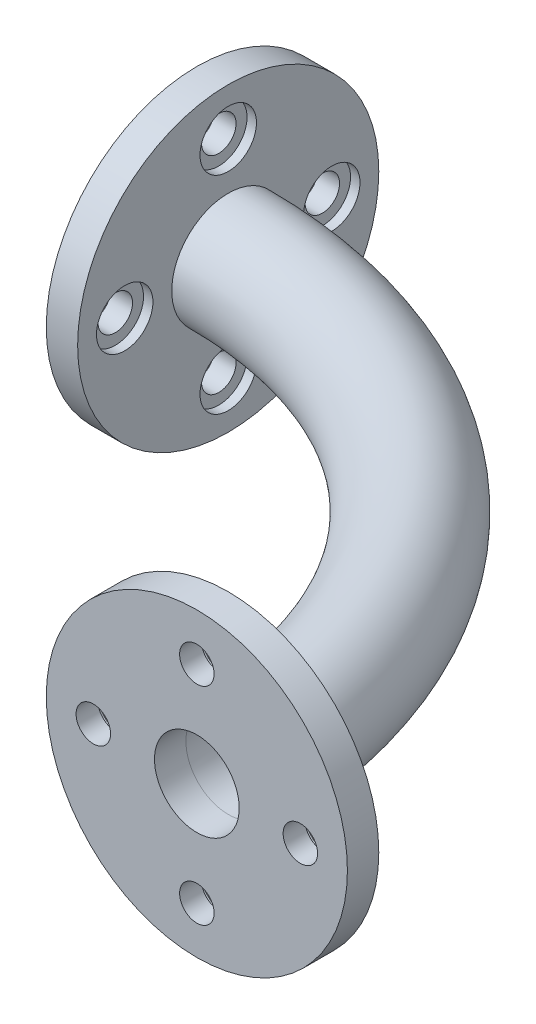
ISO-10303-21;
HEADER;
FILE_DESCRIPTION(('STEP AP214'),'2;1');
FILE_NAME('part.step','',(''),(''),'','','');
FILE_SCHEMA(('AUTOMOTIVE_DESIGN { 1 0 10303 214 1 1 1 1 }'));
ENDSEC;
DATA;
#1=APPLICATION_CONTEXT('core data for automotive mechanical design processes');
#2=APPLICATION_PROTOCOL_DEFINITION('international standard','automotive_design',2000,#1);
#3=PRODUCT_CONTEXT('',#1,'mechanical');
#4=PRODUCT('Part','Part','',(#3));
#5=PRODUCT_RELATED_PRODUCT_CATEGORY('part','',(#4));
#6=PRODUCT_DEFINITION_FORMATION('','',#4);
#7=PRODUCT_DEFINITION_CONTEXT('part definition',#1,'design');
#8=PRODUCT_DEFINITION('design','',#6,#7);
#9=PRODUCT_DEFINITION_SHAPE('','',#8);
#10=(LENGTH_UNIT() NAMED_UNIT(*) SI_UNIT(.MILLI.,.METRE.));
#11=(NAMED_UNIT(*) PLANE_ANGLE_UNIT() SI_UNIT($,.RADIAN.));
#12=(NAMED_UNIT(*) SI_UNIT($,.STERADIAN.) SOLID_ANGLE_UNIT());
#13=UNCERTAINTY_MEASURE_WITH_UNIT(LENGTH_MEASURE(1.E-05),#10,'distance_accuracy_value','');
#14=(GEOMETRIC_REPRESENTATION_CONTEXT(3) GLOBAL_UNCERTAINTY_ASSIGNED_CONTEXT((#13)) GLOBAL_UNIT_ASSIGNED_CONTEXT((#10,
#11,#12)) REPRESENTATION_CONTEXT('',''));
#15=CARTESIAN_POINT('',(0.,0.,0.));
#16=DIRECTION('',(0.,0.,1.));
#17=DIRECTION('',(1.,0.,0.));
#18=AXIS2_PLACEMENT_3D('',#15,#16,#17);
#19=CARTESIAN_POINT('',(150.,33.,140.));
#20=DIRECTION('',(0.,0.,1.));
#21=DIRECTION('',(1.,0.,0.));
#22=AXIS2_PLACEMENT_3D('',#19,#20,#21);
#23=CYLINDRICAL_SURFACE('',#22,5.49999999999999);
#24=CARTESIAN_POINT('',(150.,33.,150.));
#25=DIRECTION('',(0.,0.,1.));
#26=DIRECTION('',(1.,0.,0.));
#27=AXIS2_PLACEMENT_3D('',#24,#25,#26);
#28=CIRCLE('',#27,5.49999999999999);
#29=CARTESIAN_POINT('',(155.5,33.,150.));
#30=VERTEX_POINT('',#29);
#31=EDGE_CURVE('E116',#30,#30,#28,.T.);
#32=ORIENTED_EDGE('',*,*,#31,.T.);
#33=EDGE_LOOP('',(#32));
#34=FACE_BOUND('',#33,.T.);
#35=CARTESIAN_POINT('',(150.,33.,143.));
#36=DIRECTION('',(0.,0.,-1.));
#37=DIRECTION('',(-1.,0.,0.));
#38=AXIS2_PLACEMENT_3D('',#35,#36,#37);
#39=CIRCLE('',#38,5.49999999999999);
#40=CARTESIAN_POINT('',(144.5,33.,143.));
#41=VERTEX_POINT('',#40);
#42=EDGE_CURVE('E37',#41,#41,#39,.F.);
#43=ORIENTED_EDGE('',*,*,#42,.F.);
#44=EDGE_LOOP('',(#43));
#45=FACE_BOUND('',#44,.T.);
#46=ADVANCED_FACE('F33',(#34,#45),#23,.F.);
#47=CARTESIAN_POINT('',(183.,0.,140.));
#48=DIRECTION('',(0.,0.,1.));
#49=DIRECTION('',(1.,0.,0.));
#50=AXIS2_PLACEMENT_3D('',#47,#48,#49);
#51=CYLINDRICAL_SURFACE('',#50,5.49999999999999);
#52=CARTESIAN_POINT('',(183.,0.,150.));
#53=DIRECTION('',(0.,0.,1.));
#54=DIRECTION('',(1.,0.,0.));
#55=AXIS2_PLACEMENT_3D('',#52,#53,#54);
#56=CIRCLE('',#55,5.49999999999999);
#57=CARTESIAN_POINT('',(188.5,0.,150.));
#58=VERTEX_POINT('',#57);
#59=EDGE_CURVE('E113',#58,#58,#56,.T.);
#60=ORIENTED_EDGE('',*,*,#59,.T.);
#61=EDGE_LOOP('',(#60));
#62=FACE_BOUND('',#61,.T.);
#63=CARTESIAN_POINT('',(183.,0.,143.));
#64=DIRECTION('',(0.,0.,-1.));
#65=DIRECTION('',(-1.,0.,0.));
#66=AXIS2_PLACEMENT_3D('',#63,#64,#65);
#67=CIRCLE('',#66,5.49999999999999);
#68=CARTESIAN_POINT('',(177.5,0.,143.));
#69=VERTEX_POINT('',#68);
#70=EDGE_CURVE('E90',#69,#69,#67,.F.);
#71=ORIENTED_EDGE('',*,*,#70,.F.);
#72=EDGE_LOOP('',(#71));
#73=FACE_BOUND('',#72,.T.);
#74=ADVANCED_FACE('F187',(#62,#73),#51,.F.);
#75=CARTESIAN_POINT('',(150.,-33.,140.));
#76=DIRECTION('',(0.,0.,1.));
#77=DIRECTION('',(1.,0.,0.));
#78=AXIS2_PLACEMENT_3D('',#75,#76,#77);
#79=CYLINDRICAL_SURFACE('',#78,5.50000000000002);
#80=CARTESIAN_POINT('',(150.,-33.,150.));
#81=DIRECTION('',(0.,0.,1.));
#82=DIRECTION('',(1.,0.,0.));
#83=AXIS2_PLACEMENT_3D('',#80,#81,#82);
#84=CIRCLE('',#83,5.50000000000002);
#85=CARTESIAN_POINT('',(155.5,-33.,150.));
#86=VERTEX_POINT('',#85);
#87=EDGE_CURVE('E110',#86,#86,#84,.T.);
#88=ORIENTED_EDGE('',*,*,#87,.T.);
#89=EDGE_LOOP('',(#88));
#90=FACE_BOUND('',#89,.T.);
#91=CARTESIAN_POINT('',(150.,-33.,143.));
#92=DIRECTION('',(0.,0.,-1.));
#93=DIRECTION('',(-1.,0.,0.));
#94=AXIS2_PLACEMENT_3D('',#91,#92,#93);
#95=CIRCLE('',#94,5.50000000000002);
#96=CARTESIAN_POINT('',(144.5,-33.,143.));
#97=VERTEX_POINT('',#96);
#98=EDGE_CURVE('E87',#97,#97,#95,.F.);
#99=ORIENTED_EDGE('',*,*,#98,.F.);
#100=EDGE_LOOP('',(#99));
#101=FACE_BOUND('',#100,.T.);
#102=ADVANCED_FACE('F193',(#90,#101),#79,.F.);
#103=CARTESIAN_POINT('',(117.,0.,140.));
#104=DIRECTION('',(0.,0.,1.));
#105=DIRECTION('',(1.,0.,0.));
#106=AXIS2_PLACEMENT_3D('',#103,#104,#105);
#107=CYLINDRICAL_SURFACE('',#106,5.49999999999999);
#108=CARTESIAN_POINT('',(117.,0.,150.));
#109=DIRECTION('',(0.,0.,1.));
#110=DIRECTION('',(1.,0.,0.));
#111=AXIS2_PLACEMENT_3D('',#108,#109,#110);
#112=CIRCLE('',#111,5.49999999999999);
#113=CARTESIAN_POINT('',(122.5,0.,150.));
#114=VERTEX_POINT('',#113);
#115=EDGE_CURVE('E83',#114,#114,#112,.T.);
#116=ORIENTED_EDGE('',*,*,#115,.T.);
#117=EDGE_LOOP('',(#116));
#118=FACE_BOUND('',#117,.T.);
#119=CARTESIAN_POINT('',(117.,0.,143.));
#120=DIRECTION('',(0.,0.,-1.));
#121=DIRECTION('',(-1.,0.,0.));
#122=AXIS2_PLACEMENT_3D('',#119,#120,#121);
#123=CIRCLE('',#122,5.49999999999999);
#124=CARTESIAN_POINT('',(111.5,0.,143.));
#125=VERTEX_POINT('',#124);
#126=EDGE_CURVE('E84',#125,#125,#123,.F.);
#127=ORIENTED_EDGE('',*,*,#126,.F.);
#128=EDGE_LOOP('',(#127));
#129=FACE_BOUND('',#128,.T.);
#130=ADVANCED_FACE('F221',(#118,#129),#107,.F.);
#131=CARTESIAN_POINT('',(10.,33.,0.));
#132=DIRECTION('',(-1.,0.,0.));
#133=DIRECTION('',(0.,0.,1.));
#134=AXIS2_PLACEMENT_3D('',#131,#132,#133);
#135=CYLINDRICAL_SURFACE('',#134,5.5);
#136=CARTESIAN_POINT('',(0.,33.,0.));
#137=DIRECTION('',(1.,0.,0.));
#138=DIRECTION('',(0.,0.,-1.));
#139=AXIS2_PLACEMENT_3D('',#136,#137,#138);
#140=CIRCLE('',#139,5.5);
#141=CARTESIAN_POINT('',(0.,33.,-5.5));
#142=VERTEX_POINT('',#141);
#143=EDGE_CURVE('E62',#142,#142,#140,.T.);
#144=ORIENTED_EDGE('',*,*,#143,.F.);
#145=EDGE_LOOP('',(#144));
#146=FACE_BOUND('',#145,.T.);
#147=CARTESIAN_POINT('',(7.,33.,0.));
#148=DIRECTION('',(1.,0.,0.));
#149=DIRECTION('',(0.,0.,-1.));
#150=AXIS2_PLACEMENT_3D('',#147,#148,#149);
#151=CIRCLE('',#150,5.5);
#152=CARTESIAN_POINT('',(7.,33.,-5.5));
#153=VERTEX_POINT('',#152);
#154=EDGE_CURVE('E80',#153,#153,#151,.T.);
#155=ORIENTED_EDGE('',*,*,#154,.T.);
#156=EDGE_LOOP('',(#155));
#157=FACE_BOUND('',#156,.T.);
#158=ADVANCED_FACE('F218',(#146,#157),#135,.F.);
#159=CARTESIAN_POINT('',(10.,0.,-33.));
#160=DIRECTION('',(-1.,0.,0.));
#161=DIRECTION('',(0.,0.,1.));
#162=AXIS2_PLACEMENT_3D('',#159,#160,#161);
#163=CYLINDRICAL_SURFACE('',#162,5.5);
#164=CARTESIAN_POINT('',(0.,0.,-33.));
#165=DIRECTION('',(1.,0.,0.));
#166=DIRECTION('',(0.,0.,-1.));
#167=AXIS2_PLACEMENT_3D('',#164,#165,#166);
#168=CIRCLE('',#167,5.5);
#169=CARTESIAN_POINT('',(0.,0.,-38.5));
#170=VERTEX_POINT('',#169);
#171=EDGE_CURVE('E59',#170,#170,#168,.T.);
#172=ORIENTED_EDGE('',*,*,#171,.F.);
#173=EDGE_LOOP('',(#172));
#174=FACE_BOUND('',#173,.T.);
#175=CARTESIAN_POINT('',(7.,0.,-33.));
#176=DIRECTION('',(1.,0.,0.));
#177=DIRECTION('',(0.,0.,-1.));
#178=AXIS2_PLACEMENT_3D('',#175,#176,#177);
#179=CIRCLE('',#178,5.5);
#180=CARTESIAN_POINT('',(7.,0.,-38.5));
#181=VERTEX_POINT('',#180);
#182=EDGE_CURVE('E77',#181,#181,#179,.T.);
#183=ORIENTED_EDGE('',*,*,#182,.T.);
#184=EDGE_LOOP('',(#183));
#185=FACE_BOUND('',#184,.T.);
#186=ADVANCED_FACE('F214',(#174,#185),#163,.F.);
#187=CARTESIAN_POINT('',(10.,-33.,0.));
#188=DIRECTION('',(-1.,0.,0.));
#189=DIRECTION('',(0.,0.,1.));
#190=AXIS2_PLACEMENT_3D('',#187,#188,#189);
#191=CYLINDRICAL_SURFACE('',#190,5.5);
#192=CARTESIAN_POINT('',(0.,-33.,0.));
#193=DIRECTION('',(1.,0.,0.));
#194=DIRECTION('',(0.,0.,-1.));
#195=AXIS2_PLACEMENT_3D('',#192,#193,#194);
#196=CIRCLE('',#195,5.5);
#197=CARTESIAN_POINT('',(0.,-33.,-5.5));
#198=VERTEX_POINT('',#197);
#199=EDGE_CURVE('E55',#198,#198,#196,.T.);
#200=ORIENTED_EDGE('',*,*,#199,.F.);
#201=EDGE_LOOP('',(#200));
#202=FACE_BOUND('',#201,.T.);
#203=CARTESIAN_POINT('',(7.,-33.,0.));
#204=DIRECTION('',(1.,0.,0.));
#205=DIRECTION('',(0.,0.,-1.));
#206=AXIS2_PLACEMENT_3D('',#203,#204,#205);
#207=CIRCLE('',#206,5.5);
#208=CARTESIAN_POINT('',(7.,-33.,-5.5));
#209=VERTEX_POINT('',#208);
#210=EDGE_CURVE('E73',#209,#209,#207,.T.);
#211=ORIENTED_EDGE('',*,*,#210,.T.);
#212=EDGE_LOOP('',(#211));
#213=FACE_BOUND('',#212,.T.);
#214=ADVANCED_FACE('F166',(#202,#213),#191,.F.);
#215=CARTESIAN_POINT('',(10.,0.,33.));
#216=DIRECTION('',(-1.,0.,0.));
#217=DIRECTION('',(0.,0.,1.));
#218=AXIS2_PLACEMENT_3D('',#215,#216,#217);
#219=CYLINDRICAL_SURFACE('',#218,5.5);
#220=CARTESIAN_POINT('',(0.,0.,33.));
#221=DIRECTION('',(1.,0.,0.));
#222=DIRECTION('',(0.,0.,-1.));
#223=AXIS2_PLACEMENT_3D('',#220,#221,#222);
#224=CIRCLE('',#223,5.5);
#225=CARTESIAN_POINT('',(0.,0.,27.5));
#226=VERTEX_POINT('',#225);
#227=EDGE_CURVE('E52',#226,#226,#224,.T.);
#228=ORIENTED_EDGE('',*,*,#227,.F.);
#229=EDGE_LOOP('',(#228));
#230=FACE_BOUND('',#229,.T.);
#231=CARTESIAN_POINT('',(7.,0.,33.));
#232=DIRECTION('',(1.,0.,0.));
#233=DIRECTION('',(0.,0.,-1.));
#234=AXIS2_PLACEMENT_3D('',#231,#232,#233);
#235=CIRCLE('',#234,5.5);
#236=CARTESIAN_POINT('',(7.,0.,27.5));
#237=VERTEX_POINT('',#236);
#238=EDGE_CURVE('E70',#237,#237,#235,.T.);
#239=ORIENTED_EDGE('',*,*,#238,.T.);
#240=EDGE_LOOP('',(#239));
#241=FACE_BOUND('',#240,.T.);
#242=ADVANCED_FACE('F163',(#230,#241),#219,.F.);
#243=CARTESIAN_POINT('',(10.,0.,0.));
#244=DIRECTION('',(1.,0.,0.));
#245=DIRECTION('',(0.,0.,-1.));
#246=AXIS2_PLACEMENT_3D('',#243,#244,#245);
#247=PLANE('',#246);
#248=CARTESIAN_POINT('',(10.,33.,0.));
#249=DIRECTION('',(1.,0.,0.));
#250=DIRECTION('',(0.,0.,-1.));
#251=AXIS2_PLACEMENT_3D('',#248,#249,#250);
#252=CIRCLE('',#251,9.);
#253=CARTESIAN_POINT('',(10.,33.,-9.));
#254=VERTEX_POINT('',#253);
#255=EDGE_CURVE('E231',#254,#254,#252,.T.);
#256=ORIENTED_EDGE('',*,*,#255,.F.);
#257=EDGE_LOOP('',(#256));
#258=FACE_BOUND('',#257,.T.);
#259=CARTESIAN_POINT('',(10.,0.,-33.));
#260=DIRECTION('',(1.,0.,0.));
#261=DIRECTION('',(0.,0.,-1.));
#262=AXIS2_PLACEMENT_3D('',#259,#260,#261);
#263=CIRCLE('',#262,9.);
#264=CARTESIAN_POINT('',(10.,0.,-42.));
#265=VERTEX_POINT('',#264);
#266=EDGE_CURVE('E235',#265,#265,#263,.T.);
#267=ORIENTED_EDGE('',*,*,#266,.F.);
#268=EDGE_LOOP('',(#267));
#269=FACE_BOUND('',#268,.T.);
#270=CARTESIAN_POINT('',(10.,-33.,0.));
#271=DIRECTION('',(1.,0.,0.));
#272=DIRECTION('',(0.,0.,-1.));
#273=AXIS2_PLACEMENT_3D('',#270,#271,#272);
#274=CIRCLE('',#273,9.);
#275=CARTESIAN_POINT('',(10.,-33.,-9.));
#276=VERTEX_POINT('',#275);
#277=EDGE_CURVE('E104',#276,#276,#274,.T.);
#278=ORIENTED_EDGE('',*,*,#277,.F.);
#279=EDGE_LOOP('',(#278));
#280=FACE_BOUND('',#279,.T.);
#281=CARTESIAN_POINT('',(10.,0.,33.));
#282=DIRECTION('',(1.,0.,0.));
#283=DIRECTION('',(0.,0.,-1.));
#284=AXIS2_PLACEMENT_3D('',#281,#282,#283);
#285=CIRCLE('',#284,9.);
#286=CARTESIAN_POINT('',(10.,0.,24.));
#287=VERTEX_POINT('',#286);
#288=EDGE_CURVE('E95',#287,#287,#285,.T.);
#289=ORIENTED_EDGE('',*,*,#288,.F.);
#290=EDGE_LOOP('',(#289));
#291=FACE_BOUND('',#290,.T.);
#292=CARTESIAN_POINT('',(10.,0.,0.));
#293=DIRECTION('',(1.,0.,0.));
#294=DIRECTION('',(0.,0.,-1.));
#295=AXIS2_PLACEMENT_3D('',#292,#293,#294);
#296=CIRCLE('',#295,18.);
#297=CARTESIAN_POINT('',(10.,0.,-18.));
#298=VERTEX_POINT('',#297);
#299=EDGE_CURVE('E10',#298,#298,#296,.T.);
#300=ORIENTED_EDGE('',*,*,#299,.F.);
#301=EDGE_LOOP('',(#300));
#302=FACE_BOUND('',#301,.T.);
#303=CARTESIAN_POINT('',(10.,0.,0.));
#304=DIRECTION('',(1.,0.,0.));
#305=DIRECTION('',(0.,0.,-1.));
#306=AXIS2_PLACEMENT_3D('',#303,#304,#305);
#307=CIRCLE('',#306,48.);
#308=CARTESIAN_POINT('',(10.,0.,-48.));
#309=VERTEX_POINT('',#308);
#310=EDGE_CURVE('E41',#309,#309,#307,.T.);
#311=ORIENTED_EDGE('',*,*,#310,.T.);
#312=EDGE_LOOP('',(#311));
#313=FACE_BOUND('',#312,.T.);
#314=ADVANCED_FACE('F153',(#258,#269,#280,#291,#302,#313),#247,.T.);
#315=CARTESIAN_POINT('',(0.,0.,0.));
#316=DIRECTION('',(1.,0.,0.));
#317=DIRECTION('',(0.,0.,-1.));
#318=AXIS2_PLACEMENT_3D('',#315,#316,#317);
#319=PLANE('',#318);
#320=CARTESIAN_POINT('',(0.,0.,0.));
#321=DIRECTION('',(1.,0.,0.));
#322=DIRECTION('',(0.,0.,-1.));
#323=AXIS2_PLACEMENT_3D('',#320,#321,#322);
#324=CIRCLE('',#323,48.);
#325=CARTESIAN_POINT('',(0.,0.,-48.));
#326=VERTEX_POINT('',#325);
#327=EDGE_CURVE('E46',#326,#326,#324,.T.);
#328=ORIENTED_EDGE('',*,*,#327,.F.);
#329=EDGE_LOOP('',(#328));
#330=FACE_BOUND('',#329,.T.);
#331=CARTESIAN_POINT('',(0.,0.,0.));
#332=DIRECTION('',(1.,0.,0.));
#333=DIRECTION('',(0.,0.,-1.));
#334=AXIS2_PLACEMENT_3D('',#331,#332,#333);
#335=CIRCLE('',#334,13.5);
#336=CARTESIAN_POINT('',(0.,0.,-13.5));
#337=VERTEX_POINT('',#336);
#338=EDGE_CURVE('E65',#337,#337,#335,.T.);
#339=ORIENTED_EDGE('',*,*,#338,.T.);
#340=EDGE_LOOP('',(#339));
#341=FACE_BOUND('',#340,.T.);
#342=ORIENTED_EDGE('',*,*,#143,.T.);
#343=EDGE_LOOP('',(#342));
#344=FACE_BOUND('',#343,.T.);
#345=ORIENTED_EDGE('',*,*,#171,.T.);
#346=EDGE_LOOP('',(#345));
#347=FACE_BOUND('',#346,.T.);
#348=ORIENTED_EDGE('',*,*,#199,.T.);
#349=EDGE_LOOP('',(#348));
#350=FACE_BOUND('',#349,.T.);
#351=ORIENTED_EDGE('',*,*,#227,.T.);
#352=EDGE_LOOP('',(#351));
#353=FACE_BOUND('',#352,.T.);
#354=ADVANCED_FACE('F150',(#330,#341,#344,#347,#350,#353),#319,.F.);
#355=CARTESIAN_POINT('',(10.,0.,0.));
#356=DIRECTION('',(-1.,0.,0.));
#357=DIRECTION('',(0.,0.,1.));
#358=AXIS2_PLACEMENT_3D('',#355,#356,#357);
#359=CYLINDRICAL_SURFACE('',#358,48.);
#360=ORIENTED_EDGE('',*,*,#310,.F.);
#361=EDGE_LOOP('',(#360));
#362=FACE_BOUND('',#361,.T.);
#363=ORIENTED_EDGE('',*,*,#327,.T.);
#364=EDGE_LOOP('',(#363));
#365=FACE_BOUND('',#364,.T.);
#366=ADVANCED_FACE('F35',(#362,#365),#359,.T.);
#367=CARTESIAN_POINT('',(10.,0.,0.));
#368=DIRECTION('',(-1.,0.,0.));
#369=DIRECTION('',(0.,0.,1.));
#370=AXIS2_PLACEMENT_3D('',#367,#368,#369);
#371=CYLINDRICAL_SURFACE('',#370,13.5);
#372=CARTESIAN_POINT('',(10.,0.,0.));
#373=DIRECTION('',(1.,0.,0.));
#374=DIRECTION('',(0.,0.,-1.));
#375=AXIS2_PLACEMENT_3D('',#372,#373,#374);
#376=CIRCLE('',#375,13.5);
#377=CARTESIAN_POINT('',(10.,0.,-13.5));
#378=VERTEX_POINT('',#377);
#379=EDGE_CURVE('E128',#378,#378,#376,.F.);
#380=ORIENTED_EDGE('',*,*,#379,.F.);
#381=EDGE_LOOP('',(#380));
#382=FACE_BOUND('',#381,.T.);
#383=ORIENTED_EDGE('',*,*,#338,.F.);
#384=EDGE_LOOP('',(#383));
#385=FACE_BOUND('',#384,.T.);
#386=ADVANCED_FACE('F142',(#382,#385),#371,.F.);
#387=CARTESIAN_POINT('',(9.99999999999999,0.,140.));
#388=DIRECTION('',(0.,-1.,0.));
#389=DIRECTION('',(0.,0.,-1.));
#390=AXIS2_PLACEMENT_3D('',#387,#388,#389);
#391=TOROIDAL_SURFACE('',#390,140.,18.);
#392=CARTESIAN_POINT('',(150.,0.,140.));
#393=DIRECTION('',(0.,0.,1.));
#394=DIRECTION('',(1.,0.,0.));
#395=AXIS2_PLACEMENT_3D('',#392,#393,#394);
#396=CIRCLE('',#395,18.);
#397=CARTESIAN_POINT('',(168.,0.,140.));
#398=VERTEX_POINT('',#397);
#399=EDGE_CURVE('E50',#398,#398,#396,.T.);
#400=CARTESIAN_POINT('',(9.99999999999999,0.,140.));
#401=DIRECTION('',(0.,-1.,0.));
#402=DIRECTION('',(0.,0.,-1.));
#403=AXIS2_PLACEMENT_3D('',#400,#401,#402);
#404=CIRCLE('',#403,158.);
#405=EDGE_CURVE('',#298,#398,#404,.T.);
#406=ORIENTED_EDGE('',*,*,#299,.T.);
#407=ORIENTED_EDGE('',*,*,#399,.F.);
#408=ORIENTED_EDGE('',*,*,#405,.T.);
#409=ORIENTED_EDGE('',*,*,#405,.F.);
#410=EDGE_LOOP('',(#406,#408,#407,#409));
#411=FACE_BOUND('',#410,.T.);
#412=ADVANCED_FACE('F140',(#411),#391,.T.);
#413=CARTESIAN_POINT('',(9.99999999999999,0.,140.));
#414=DIRECTION('',(0.,-1.,0.));
#415=DIRECTION('',(0.,0.,-1.));
#416=AXIS2_PLACEMENT_3D('',#413,#414,#415);
#417=TOROIDAL_SURFACE('',#416,140.,13.5);
#418=CARTESIAN_POINT('',(150.,0.,140.));
#419=DIRECTION('',(0.,0.,1.));
#420=DIRECTION('',(1.,0.,0.));
#421=AXIS2_PLACEMENT_3D('',#418,#419,#420);
#422=CIRCLE('',#421,13.5);
#423=CARTESIAN_POINT('',(163.5,0.,140.));
#424=VERTEX_POINT('',#423);
#425=EDGE_CURVE('E56',#424,#424,#422,.F.);
#426=CARTESIAN_POINT('',(9.99999999999999,0.,140.));
#427=DIRECTION('',(0.,-1.,0.));
#428=DIRECTION('',(0.,0.,-1.));
#429=AXIS2_PLACEMENT_3D('',#426,#427,#428);
#430=CIRCLE('',#429,153.5);
#431=EDGE_CURVE('',#378,#424,#430,.T.);
#432=ORIENTED_EDGE('',*,*,#379,.T.);
#433=ORIENTED_EDGE('',*,*,#425,.F.);
#434=ORIENTED_EDGE('',*,*,#431,.T.);
#435=ORIENTED_EDGE('',*,*,#431,.F.);
#436=EDGE_LOOP('',(#432,#434,#433,#435));
#437=FACE_BOUND('',#436,.T.);
#438=ADVANCED_FACE('F136',(#437),#417,.F.);
#439=CARTESIAN_POINT('',(150.,0.,140.));
#440=DIRECTION('',(0.,0.,1.));
#441=DIRECTION('',(1.,0.,0.));
#442=AXIS2_PLACEMENT_3D('',#439,#440,#441);
#443=CYLINDRICAL_SURFACE('',#442,48.);
#444=CARTESIAN_POINT('',(150.,0.,140.));
#445=DIRECTION('',(0.,0.,1.));
#446=DIRECTION('',(1.,0.,0.));
#447=AXIS2_PLACEMENT_3D('',#444,#445,#446);
#448=CIRCLE('',#447,48.);
#449=CARTESIAN_POINT('',(198.,0.,140.));
#450=VERTEX_POINT('',#449);
#451=EDGE_CURVE('E123',#450,#450,#448,.T.);
#452=ORIENTED_EDGE('',*,*,#451,.T.);
#453=EDGE_LOOP('',(#452));
#454=FACE_BOUND('',#453,.T.);
#455=CARTESIAN_POINT('',(150.,0.,150.));
#456=DIRECTION('',(0.,0.,1.));
#457=DIRECTION('',(1.,0.,0.));
#458=AXIS2_PLACEMENT_3D('',#455,#456,#457);
#459=CIRCLE('',#458,48.);
#460=CARTESIAN_POINT('',(198.,0.,150.));
#461=VERTEX_POINT('',#460);
#462=EDGE_CURVE('E122',#461,#461,#459,.T.);
#463=ORIENTED_EDGE('',*,*,#462,.F.);
#464=EDGE_LOOP('',(#463));
#465=FACE_BOUND('',#464,.T.);
#466=ADVANCED_FACE('F139',(#454,#465),#443,.T.);
#467=CARTESIAN_POINT('',(150.,0.,140.));
#468=DIRECTION('',(0.,0.,1.));
#469=DIRECTION('',(1.,0.,0.));
#470=AXIS2_PLACEMENT_3D('',#467,#468,#469);
#471=PLANE('',#470);
#472=CARTESIAN_POINT('',(150.,33.,140.));
#473=DIRECTION('',(0.,0.,-1.));
#474=DIRECTION('',(-1.,0.,0.));
#475=AXIS2_PLACEMENT_3D('',#472,#473,#474);
#476=CIRCLE('',#475,9.00000000000001);
#477=CARTESIAN_POINT('',(141.,33.,140.));
#478=VERTEX_POINT('',#477);
#479=EDGE_CURVE('E487',#478,#478,#476,.T.);
#480=ORIENTED_EDGE('',*,*,#479,.F.);
#481=EDGE_LOOP('',(#480));
#482=FACE_BOUND('',#481,.T.);
#483=CARTESIAN_POINT('',(117.,0.,140.));
#484=DIRECTION('',(0.,0.,-1.));
#485=DIRECTION('',(-1.,0.,0.));
#486=AXIS2_PLACEMENT_3D('',#483,#484,#485);
#487=CIRCLE('',#486,9.00000000000001);
#488=CARTESIAN_POINT('',(108.,0.,140.));
#489=VERTEX_POINT('',#488);
#490=EDGE_CURVE('E482',#489,#489,#487,.T.);
#491=ORIENTED_EDGE('',*,*,#490,.F.);
#492=EDGE_LOOP('',(#491));
#493=FACE_BOUND('',#492,.T.);
#494=CARTESIAN_POINT('',(150.,-33.,140.));
#495=DIRECTION('',(0.,0.,-1.));
#496=DIRECTION('',(-1.,0.,0.));
#497=AXIS2_PLACEMENT_3D('',#494,#495,#496);
#498=CIRCLE('',#497,9.00000000000004);
#499=CARTESIAN_POINT('',(141.,-33.,140.));
#500=VERTEX_POINT('',#499);
#501=EDGE_CURVE('E455',#500,#500,#498,.T.);
#502=ORIENTED_EDGE('',*,*,#501,.F.);
#503=EDGE_LOOP('',(#502));
#504=FACE_BOUND('',#503,.T.);
#505=CARTESIAN_POINT('',(183.,0.,140.));
#506=DIRECTION('',(0.,0.,-1.));
#507=DIRECTION('',(-1.,0.,0.));
#508=AXIS2_PLACEMENT_3D('',#505,#506,#507);
#509=CIRCLE('',#508,9.00000000000001);
#510=CARTESIAN_POINT('',(174.,0.,140.));
#511=VERTEX_POINT('',#510);
#512=EDGE_CURVE('E452',#511,#511,#509,.T.);
#513=ORIENTED_EDGE('',*,*,#512,.F.);
#514=EDGE_LOOP('',(#513));
#515=FACE_BOUND('',#514,.T.);
#516=ORIENTED_EDGE('',*,*,#399,.T.);
#517=EDGE_LOOP('',(#516));
#518=FACE_BOUND('',#517,.T.);
#519=ORIENTED_EDGE('',*,*,#451,.F.);
#520=EDGE_LOOP('',(#519));
#521=FACE_BOUND('',#520,.T.);
#522=ADVANCED_FACE('F199',(#482,#493,#504,#515,#518,#521),#471,.F.);
#523=CARTESIAN_POINT('',(150.,0.,150.));
#524=DIRECTION('',(0.,0.,1.));
#525=DIRECTION('',(1.,0.,0.));
#526=AXIS2_PLACEMENT_3D('',#523,#524,#525);
#527=PLANE('',#526);
#528=ORIENTED_EDGE('',*,*,#115,.F.);
#529=EDGE_LOOP('',(#528));
#530=FACE_BOUND('',#529,.T.);
#531=ORIENTED_EDGE('',*,*,#87,.F.);
#532=EDGE_LOOP('',(#531));
#533=FACE_BOUND('',#532,.T.);
#534=ORIENTED_EDGE('',*,*,#59,.F.);
#535=EDGE_LOOP('',(#534));
#536=FACE_BOUND('',#535,.T.);
#537=ORIENTED_EDGE('',*,*,#31,.F.);
#538=EDGE_LOOP('',(#537));
#539=FACE_BOUND('',#538,.T.);
#540=CARTESIAN_POINT('',(150.,0.,150.));
#541=DIRECTION('',(0.,0.,1.));
#542=DIRECTION('',(1.,0.,0.));
#543=AXIS2_PLACEMENT_3D('',#540,#541,#542);
#544=CIRCLE('',#543,13.5);
#545=CARTESIAN_POINT('',(163.5,0.,150.));
#546=VERTEX_POINT('',#545);
#547=EDGE_CURVE('E119',#546,#546,#544,.T.);
#548=ORIENTED_EDGE('',*,*,#547,.F.);
#549=EDGE_LOOP('',(#548));
#550=FACE_BOUND('',#549,.T.);
#551=ORIENTED_EDGE('',*,*,#462,.T.);
#552=EDGE_LOOP('',(#551));
#553=FACE_BOUND('',#552,.T.);
#554=ADVANCED_FACE('F183',(#530,#533,#536,#539,#550,#553),#527,.T.);
#555=CARTESIAN_POINT('',(150.,0.,140.));
#556=DIRECTION('',(0.,0.,1.));
#557=DIRECTION('',(1.,0.,0.));
#558=AXIS2_PLACEMENT_3D('',#555,#556,#557);
#559=CYLINDRICAL_SURFACE('',#558,13.5);
#560=ORIENTED_EDGE('',*,*,#425,.T.);
#561=EDGE_LOOP('',(#560));
#562=FACE_BOUND('',#561,.T.);
#563=ORIENTED_EDGE('',*,*,#547,.T.);
#564=EDGE_LOOP('',(#563));
#565=FACE_BOUND('',#564,.T.);
#566=ADVANCED_FACE('F133',(#562,#565),#559,.F.);
#567=CARTESIAN_POINT('',(7.,0.,33.));
#568=DIRECTION('',(1.,0.,0.));
#569=DIRECTION('',(0.,0.,-1.));
#570=AXIS2_PLACEMENT_3D('',#567,#568,#569);
#571=CYLINDRICAL_SURFACE('',#570,9.);
#572=CARTESIAN_POINT('',(7.,0.,33.));
#573=DIRECTION('',(1.,0.,0.));
#574=DIRECTION('',(0.,0.,-1.));
#575=AXIS2_PLACEMENT_3D('',#572,#573,#574);
#576=CIRCLE('',#575,9.);
#577=CARTESIAN_POINT('',(7.,0.,24.));
#578=VERTEX_POINT('',#577);
#579=EDGE_CURVE('E99',#578,#578,#576,.T.);
#580=ORIENTED_EDGE('',*,*,#579,.F.);
#581=EDGE_LOOP('',(#580));
#582=FACE_BOUND('',#581,.T.);
#583=ORIENTED_EDGE('',*,*,#288,.T.);
#584=EDGE_LOOP('',(#583));
#585=FACE_BOUND('',#584,.T.);
#586=ADVANCED_FACE('F174',(#582,#585),#571,.F.);
#587=CARTESIAN_POINT('',(7.,0.,33.));
#588=DIRECTION('',(1.,0.,0.));
#589=DIRECTION('',(0.,0.,-1.));
#590=AXIS2_PLACEMENT_3D('',#587,#588,#589);
#591=PLANE('',#590);
#592=ORIENTED_EDGE('',*,*,#238,.F.);
#593=EDGE_LOOP('',(#592));
#594=FACE_BOUND('',#593,.T.);
#595=ORIENTED_EDGE('',*,*,#579,.T.);
#596=EDGE_LOOP('',(#595));
#597=FACE_BOUND('',#596,.T.);
#598=ADVANCED_FACE('F170',(#594,#597),#591,.T.);
#599=CARTESIAN_POINT('',(7.,-33.,0.));
#600=DIRECTION('',(1.,0.,0.));
#601=DIRECTION('',(0.,0.,-1.));
#602=AXIS2_PLACEMENT_3D('',#599,#600,#601);
#603=CYLINDRICAL_SURFACE('',#602,9.);
#604=CARTESIAN_POINT('',(7.,-33.,0.));
#605=DIRECTION('',(1.,0.,0.));
#606=DIRECTION('',(0.,0.,-1.));
#607=AXIS2_PLACEMENT_3D('',#604,#605,#606);
#608=CIRCLE('',#607,9.);
#609=CARTESIAN_POINT('',(7.,-33.,-9.));
#610=VERTEX_POINT('',#609);
#611=EDGE_CURVE('E466',#610,#610,#608,.T.);
#612=ORIENTED_EDGE('',*,*,#611,.F.);
#613=EDGE_LOOP('',(#612));
#614=FACE_BOUND('',#613,.T.);
#615=ORIENTED_EDGE('',*,*,#277,.T.);
#616=EDGE_LOOP('',(#615));
#617=FACE_BOUND('',#616,.T.);
#618=ADVANCED_FACE('F173',(#614,#617),#603,.F.);
#619=CARTESIAN_POINT('',(7.,-33.,0.));
#620=DIRECTION('',(1.,0.,0.));
#621=DIRECTION('',(0.,0.,-1.));
#622=AXIS2_PLACEMENT_3D('',#619,#620,#621);
#623=PLANE('',#622);
#624=ORIENTED_EDGE('',*,*,#210,.F.);
#625=EDGE_LOOP('',(#624));
#626=FACE_BOUND('',#625,.T.);
#627=ORIENTED_EDGE('',*,*,#611,.T.);
#628=EDGE_LOOP('',(#627));
#629=FACE_BOUND('',#628,.T.);
#630=ADVANCED_FACE('F329',(#626,#629),#623,.T.);
#631=CARTESIAN_POINT('',(7.,0.,-33.));
#632=DIRECTION('',(1.,0.,0.));
#633=DIRECTION('',(0.,0.,-1.));
#634=AXIS2_PLACEMENT_3D('',#631,#632,#633);
#635=CYLINDRICAL_SURFACE('',#634,9.);
#636=CARTESIAN_POINT('',(7.,0.,-33.));
#637=DIRECTION('',(1.,0.,0.));
#638=DIRECTION('',(0.,0.,-1.));
#639=AXIS2_PLACEMENT_3D('',#636,#637,#638);
#640=CIRCLE('',#639,9.);
#641=CARTESIAN_POINT('',(7.,0.,-42.));
#642=VERTEX_POINT('',#641);
#643=EDGE_CURVE('E462',#642,#642,#640,.T.);
#644=ORIENTED_EDGE('',*,*,#643,.F.);
#645=EDGE_LOOP('',(#644));
#646=FACE_BOUND('',#645,.T.);
#647=ORIENTED_EDGE('',*,*,#266,.T.);
#648=EDGE_LOOP('',(#647));
#649=FACE_BOUND('',#648,.T.);
#650=ADVANCED_FACE('F339',(#646,#649),#635,.F.);
#651=CARTESIAN_POINT('',(7.,0.,-33.));
#652=DIRECTION('',(1.,0.,0.));
#653=DIRECTION('',(0.,0.,-1.));
#654=AXIS2_PLACEMENT_3D('',#651,#652,#653);
#655=PLANE('',#654);
#656=ORIENTED_EDGE('',*,*,#182,.F.);
#657=EDGE_LOOP('',(#656));
#658=FACE_BOUND('',#657,.T.);
#659=ORIENTED_EDGE('',*,*,#643,.T.);
#660=EDGE_LOOP('',(#659));
#661=FACE_BOUND('',#660,.T.);
#662=ADVANCED_FACE('F349',(#658,#661),#655,.T.);
#663=CARTESIAN_POINT('',(7.,33.,0.));
#664=DIRECTION('',(1.,0.,0.));
#665=DIRECTION('',(0.,0.,-1.));
#666=AXIS2_PLACEMENT_3D('',#663,#664,#665);
#667=CYLINDRICAL_SURFACE('',#666,9.);
#668=CARTESIAN_POINT('',(7.,33.,0.));
#669=DIRECTION('',(1.,0.,0.));
#670=DIRECTION('',(0.,0.,-1.));
#671=AXIS2_PLACEMENT_3D('',#668,#669,#670);
#672=CIRCLE('',#671,9.);
#673=CARTESIAN_POINT('',(7.,33.,-9.));
#674=VERTEX_POINT('',#673);
#675=EDGE_CURVE('E74',#674,#674,#672,.T.);
#676=ORIENTED_EDGE('',*,*,#675,.F.);
#677=EDGE_LOOP('',(#676));
#678=FACE_BOUND('',#677,.T.);
#679=ORIENTED_EDGE('',*,*,#255,.T.);
#680=EDGE_LOOP('',(#679));
#681=FACE_BOUND('',#680,.T.);
#682=ADVANCED_FACE('F359',(#678,#681),#667,.F.);
#683=CARTESIAN_POINT('',(7.,33.,0.));
#684=DIRECTION('',(1.,0.,0.));
#685=DIRECTION('',(0.,0.,-1.));
#686=AXIS2_PLACEMENT_3D('',#683,#684,#685);
#687=PLANE('',#686);
#688=ORIENTED_EDGE('',*,*,#154,.F.);
#689=EDGE_LOOP('',(#688));
#690=FACE_BOUND('',#689,.T.);
#691=ORIENTED_EDGE('',*,*,#675,.T.);
#692=EDGE_LOOP('',(#691));
#693=FACE_BOUND('',#692,.T.);
#694=ADVANCED_FACE('F369',(#690,#693),#687,.T.);
#695=CARTESIAN_POINT('',(117.,0.,143.));
#696=DIRECTION('',(0.,0.,-1.));
#697=DIRECTION('',(-1.,0.,0.));
#698=AXIS2_PLACEMENT_3D('',#695,#696,#697);
#699=PLANE('',#698);
#700=CARTESIAN_POINT('',(117.,0.,143.));
#701=DIRECTION('',(0.,0.,-1.));
#702=DIRECTION('',(-1.,0.,0.));
#703=AXIS2_PLACEMENT_3D('',#700,#701,#702);
#704=CIRCLE('',#703,9.00000000000001);
#705=CARTESIAN_POINT('',(108.,0.,143.));
#706=VERTEX_POINT('',#705);
#707=EDGE_CURVE('E485',#706,#706,#704,.T.);
#708=ORIENTED_EDGE('',*,*,#707,.T.);
#709=EDGE_LOOP('',(#708));
#710=FACE_BOUND('',#709,.T.);
#711=ORIENTED_EDGE('',*,*,#126,.T.);
#712=EDGE_LOOP('',(#711));
#713=FACE_BOUND('',#712,.T.);
#714=ADVANCED_FACE('F378',(#710,#713),#699,.T.);
#715=CARTESIAN_POINT('',(117.,0.,143.));
#716=DIRECTION('',(0.,0.,-1.));
#717=DIRECTION('',(-1.,0.,0.));
#718=AXIS2_PLACEMENT_3D('',#715,#716,#717);
#719=CYLINDRICAL_SURFACE('',#718,9.00000000000001);
#720=ORIENTED_EDGE('',*,*,#707,.F.);
#721=EDGE_LOOP('',(#720));
#722=FACE_BOUND('',#721,.T.);
#723=ORIENTED_EDGE('',*,*,#490,.T.);
#724=EDGE_LOOP('',(#723));
#725=FACE_BOUND('',#724,.T.);
#726=ADVANCED_FACE('F414',(#722,#725),#719,.F.);
#727=CARTESIAN_POINT('',(150.,-33.,143.));
#728=DIRECTION('',(0.,0.,-1.));
#729=DIRECTION('',(-1.,0.,0.));
#730=AXIS2_PLACEMENT_3D('',#727,#728,#729);
#731=PLANE('',#730);
#732=CARTESIAN_POINT('',(150.,-33.,143.));
#733=DIRECTION('',(0.,0.,-1.));
#734=DIRECTION('',(-1.,0.,0.));
#735=AXIS2_PLACEMENT_3D('',#732,#733,#734);
#736=CIRCLE('',#735,9.00000000000004);
#737=CARTESIAN_POINT('',(141.,-33.,143.));
#738=VERTEX_POINT('',#737);
#739=EDGE_CURVE('E479',#738,#738,#736,.T.);
#740=ORIENTED_EDGE('',*,*,#739,.T.);
#741=EDGE_LOOP('',(#740));
#742=FACE_BOUND('',#741,.T.);
#743=ORIENTED_EDGE('',*,*,#98,.T.);
#744=EDGE_LOOP('',(#743));
#745=FACE_BOUND('',#744,.T.);
#746=ADVANCED_FACE('F419',(#742,#745),#731,.T.);
#747=CARTESIAN_POINT('',(150.,-33.,143.));
#748=DIRECTION('',(0.,0.,-1.));
#749=DIRECTION('',(-1.,0.,0.));
#750=AXIS2_PLACEMENT_3D('',#747,#748,#749);
#751=CYLINDRICAL_SURFACE('',#750,9.00000000000004);
#752=ORIENTED_EDGE('',*,*,#739,.F.);
#753=EDGE_LOOP('',(#752));
#754=FACE_BOUND('',#753,.T.);
#755=ORIENTED_EDGE('',*,*,#501,.T.);
#756=EDGE_LOOP('',(#755));
#757=FACE_BOUND('',#756,.T.);
#758=ADVANCED_FACE('F429',(#754,#757),#751,.F.);
#759=CARTESIAN_POINT('',(183.,0.,143.));
#760=DIRECTION('',(0.,0.,-1.));
#761=DIRECTION('',(-1.,0.,0.));
#762=AXIS2_PLACEMENT_3D('',#759,#760,#761);
#763=PLANE('',#762);
#764=CARTESIAN_POINT('',(183.,0.,143.));
#765=DIRECTION('',(0.,0.,-1.));
#766=DIRECTION('',(-1.,0.,0.));
#767=AXIS2_PLACEMENT_3D('',#764,#765,#766);
#768=CIRCLE('',#767,9.00000000000001);
#769=CARTESIAN_POINT('',(174.,0.,143.));
#770=VERTEX_POINT('',#769);
#771=EDGE_CURVE('E449',#770,#770,#768,.T.);
#772=ORIENTED_EDGE('',*,*,#771,.T.);
#773=EDGE_LOOP('',(#772));
#774=FACE_BOUND('',#773,.T.);
#775=ORIENTED_EDGE('',*,*,#70,.T.);
#776=EDGE_LOOP('',(#775));
#777=FACE_BOUND('',#776,.T.);
#778=ADVANCED_FACE('F433',(#774,#777),#763,.T.);
#779=CARTESIAN_POINT('',(183.,0.,143.));
#780=DIRECTION('',(0.,0.,-1.));
#781=DIRECTION('',(-1.,0.,0.));
#782=AXIS2_PLACEMENT_3D('',#779,#780,#781);
#783=CYLINDRICAL_SURFACE('',#782,9.00000000000001);
#784=ORIENTED_EDGE('',*,*,#771,.F.);
#785=EDGE_LOOP('',(#784));
#786=FACE_BOUND('',#785,.T.);
#787=ORIENTED_EDGE('',*,*,#512,.T.);
#788=EDGE_LOOP('',(#787));
#789=FACE_BOUND('',#788,.T.);
#790=ADVANCED_FACE('F437',(#786,#789),#783,.F.);
#791=CARTESIAN_POINT('',(150.,33.,143.));
#792=DIRECTION('',(0.,0.,-1.));
#793=DIRECTION('',(-1.,0.,0.));
#794=AXIS2_PLACEMENT_3D('',#791,#792,#793);
#795=PLANE('',#794);
#796=CARTESIAN_POINT('',(150.,33.,143.));
#797=DIRECTION('',(0.,0.,-1.));
#798=DIRECTION('',(-1.,0.,0.));
#799=AXIS2_PLACEMENT_3D('',#796,#797,#798);
#800=CIRCLE('',#799,9.00000000000001);
#801=CARTESIAN_POINT('',(141.,33.,143.));
#802=VERTEX_POINT('',#801);
#803=EDGE_CURVE('E88',#802,#802,#800,.T.);
#804=ORIENTED_EDGE('',*,*,#803,.T.);
#805=EDGE_LOOP('',(#804));
#806=FACE_BOUND('',#805,.T.);
#807=ORIENTED_EDGE('',*,*,#42,.T.);
#808=EDGE_LOOP('',(#807));
#809=FACE_BOUND('',#808,.T.);
#810=ADVANCED_FACE('F440',(#806,#809),#795,.T.);
#811=CARTESIAN_POINT('',(150.,33.,143.));
#812=DIRECTION('',(0.,0.,-1.));
#813=DIRECTION('',(-1.,0.,0.));
#814=AXIS2_PLACEMENT_3D('',#811,#812,#813);
#815=CYLINDRICAL_SURFACE('',#814,9.00000000000001);
#816=ORIENTED_EDGE('',*,*,#803,.F.);
#817=EDGE_LOOP('',(#816));
#818=FACE_BOUND('',#817,.T.);
#819=ORIENTED_EDGE('',*,*,#479,.T.);
#820=EDGE_LOOP('',(#819));
#821=FACE_BOUND('',#820,.T.);
#822=ADVANCED_FACE('F424',(#818,#821),#815,.F.);
#823=CLOSED_SHELL('',(#46,#74,#102,#130,#158,#186,#214,#242,#314,#354,#366,#386,#412,#438,#466,
#522,#554,#566,#586,#598,#618,#630,#650,#662,#682,#694,#714,#726,#746,#758,#778,#790,#810,#822));
#824=MANIFOLD_SOLID_BREP('B2',#823);
#825=ADVANCED_BREP_SHAPE_REPRESENTATION('',(#18,#824),#14);
#826=SHAPE_DEFINITION_REPRESENTATION(#9,#825);
ENDSEC;
END-ISO-10303-21;
